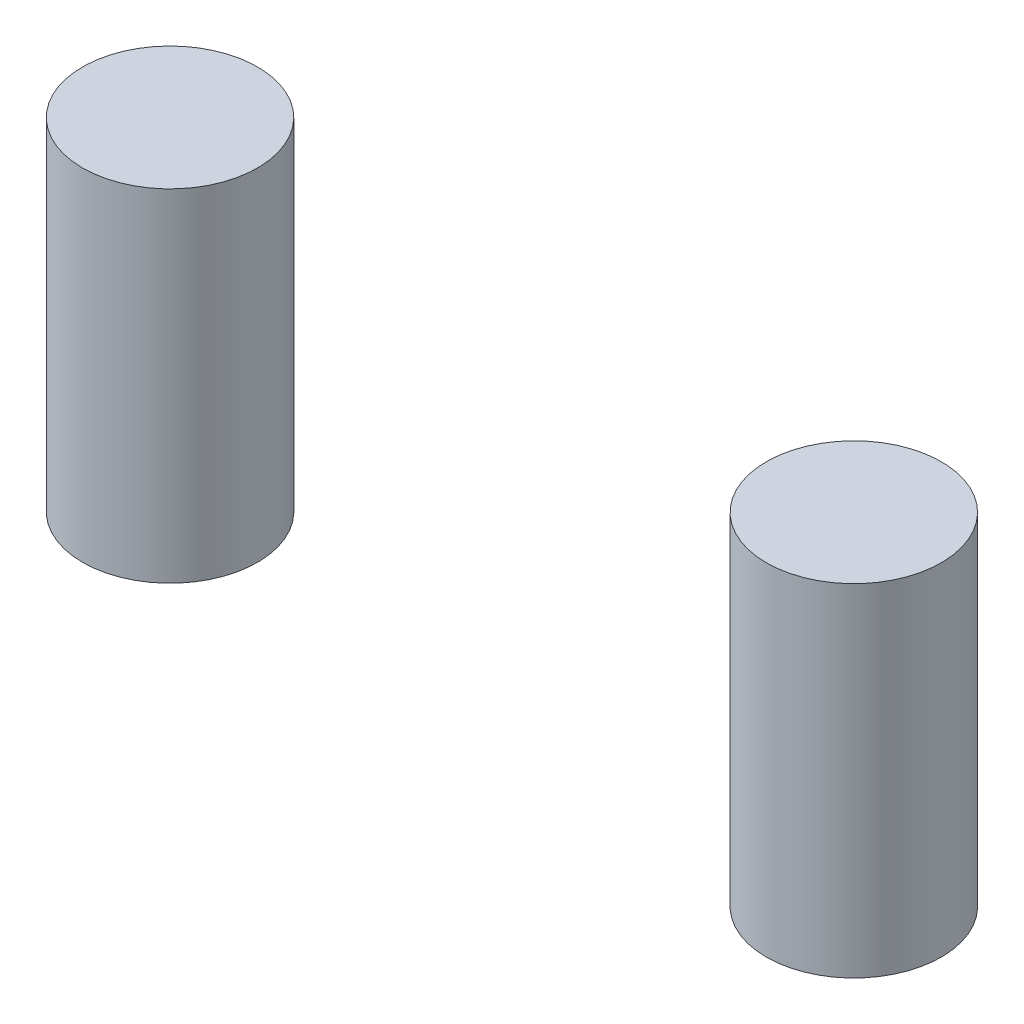
ISO-10303-21;
HEADER;
FILE_DESCRIPTION(('STEP AP214'),'2;1');
FILE_NAME('part.step','',(''),(''),'','','');
FILE_SCHEMA(('AUTOMOTIVE_DESIGN { 1 0 10303 214 1 1 1 1 }'));
ENDSEC;
DATA;
#1=APPLICATION_CONTEXT('core data for automotive mechanical design processes');
#2=APPLICATION_PROTOCOL_DEFINITION('international standard','automotive_design',2000,#1);
#3=PRODUCT_CONTEXT('',#1,'mechanical');
#4=PRODUCT('Part','Part','',(#3));
#5=PRODUCT_RELATED_PRODUCT_CATEGORY('part','',(#4));
#6=PRODUCT_DEFINITION_FORMATION('','',#4);
#7=PRODUCT_DEFINITION_CONTEXT('part definition',#1,'design');
#8=PRODUCT_DEFINITION('design','',#6,#7);
#9=PRODUCT_DEFINITION_SHAPE('','',#8);
#10=(LENGTH_UNIT() NAMED_UNIT(*) SI_UNIT(.MILLI.,.METRE.));
#11=(NAMED_UNIT(*) PLANE_ANGLE_UNIT() SI_UNIT($,.RADIAN.));
#12=(NAMED_UNIT(*) SI_UNIT($,.STERADIAN.) SOLID_ANGLE_UNIT());
#13=UNCERTAINTY_MEASURE_WITH_UNIT(LENGTH_MEASURE(1.E-05),#10,'distance_accuracy_value','');
#14=(GEOMETRIC_REPRESENTATION_CONTEXT(3) GLOBAL_UNCERTAINTY_ASSIGNED_CONTEXT((#13)) GLOBAL_UNIT_ASSIGNED_CONTEXT((#10,
#11,#12)) REPRESENTATION_CONTEXT('',''));
#15=CARTESIAN_POINT('',(0.,0.,0.));
#16=DIRECTION('',(0.,0.,1.));
#17=DIRECTION('',(1.,0.,0.));
#18=AXIS2_PLACEMENT_3D('',#15,#16,#17);
#19=CARTESIAN_POINT('',(27.125,12.,3.09999990463257));
#20=DIRECTION('',(0.,-1.,0.));
#21=DIRECTION('',(0.,0.,-1.));
#22=AXIS2_PLACEMENT_3D('',#19,#20,#21);
#23=CYLINDRICAL_SURFACE('',#22,3.075);
#24=CARTESIAN_POINT('',(27.125,12.,3.09999990463257));
#25=DIRECTION('',(0.,1.,0.));
#26=DIRECTION('',(0.,0.,1.));
#27=AXIS2_PLACEMENT_3D('',#24,#25,#26);
#28=CIRCLE('',#27,3.075);
#29=CARTESIAN_POINT('',(27.125,12.,6.17499990463257));
#30=VERTEX_POINT('',#29);
#31=EDGE_CURVE('E55',#30,#30,#28,.T.);
#32=ORIENTED_EDGE('',*,*,#31,.F.);
#33=EDGE_LOOP('',(#32));
#34=FACE_BOUND('',#33,.T.);
#35=CARTESIAN_POINT('',(27.125,0.,3.09999990463257));
#36=DIRECTION('',(0.,1.,0.));
#37=DIRECTION('',(0.,0.,1.));
#38=AXIS2_PLACEMENT_3D('',#35,#36,#37);
#39=CIRCLE('',#38,3.075);
#40=CARTESIAN_POINT('',(27.125,0.,6.17499990463257));
#41=VERTEX_POINT('',#40);
#42=EDGE_CURVE('E11',#41,#41,#39,.T.);
#43=ORIENTED_EDGE('',*,*,#42,.T.);
#44=EDGE_LOOP('',(#43));
#45=FACE_BOUND('',#44,.T.);
#46=ADVANCED_FACE('F51',(#34,#45),#23,.T.);
#47=CARTESIAN_POINT('',(27.125,12.,3.09999990463257));
#48=DIRECTION('',(0.,1.,0.));
#49=DIRECTION('',(0.,0.,1.));
#50=AXIS2_PLACEMENT_3D('',#47,#48,#49);
#51=PLANE('',#50);
#52=ORIENTED_EDGE('',*,*,#31,.T.);
#53=EDGE_LOOP('',(#52));
#54=FACE_BOUND('',#53,.T.);
#55=ADVANCED_FACE('F53',(#54),#51,.T.);
#56=CARTESIAN_POINT('',(27.125,0.,3.09999990463257));
#57=DIRECTION('',(0.,1.,0.));
#58=DIRECTION('',(0.,0.,1.));
#59=AXIS2_PLACEMENT_3D('',#56,#57,#58);
#60=PLANE('',#59);
#61=ORIENTED_EDGE('',*,*,#42,.F.);
#62=EDGE_LOOP('',(#61));
#63=FACE_BOUND('',#62,.T.);
#64=ADVANCED_FACE('F70',(#63),#60,.F.);
#65=CLOSED_SHELL('',(#46,#55,#64));
#66=MANIFOLD_SOLID_BREP('B2',#65);
#67=CARTESIAN_POINT('',(3.09999942779541,12.,3.09999990463257));
#68=DIRECTION('',(0.,-1.,0.));
#69=DIRECTION('',(0.,0.,-1.));
#70=AXIS2_PLACEMENT_3D('',#67,#68,#69);
#71=CYLINDRICAL_SURFACE('',#70,3.075);
#72=CARTESIAN_POINT('',(3.09999942779541,12.,3.09999990463257));
#73=DIRECTION('',(0.,1.,0.));
#74=DIRECTION('',(0.,0.,1.));
#75=AXIS2_PLACEMENT_3D('',#72,#73,#74);
#76=CIRCLE('',#75,3.075);
#77=CARTESIAN_POINT('',(3.09999942779541,12.,6.17499990463257));
#78=VERTEX_POINT('',#77);
#79=EDGE_CURVE('E50',#78,#78,#76,.T.);
#80=ORIENTED_EDGE('',*,*,#79,.F.);
#81=EDGE_LOOP('',(#80));
#82=FACE_BOUND('',#81,.T.);
#83=CARTESIAN_POINT('',(3.09999942779541,0.,3.09999990463257));
#84=DIRECTION('',(0.,1.,0.));
#85=DIRECTION('',(0.,0.,1.));
#86=AXIS2_PLACEMENT_3D('',#83,#84,#85);
#87=CIRCLE('',#86,3.075);
#88=CARTESIAN_POINT('',(3.09999942779541,0.,6.17499990463257));
#89=VERTEX_POINT('',#88);
#90=EDGE_CURVE('E95',#89,#89,#87,.T.);
#91=ORIENTED_EDGE('',*,*,#90,.T.);
#92=EDGE_LOOP('',(#91));
#93=FACE_BOUND('',#92,.T.);
#94=ADVANCED_FACE('F92',(#82,#93),#71,.T.);
#95=CARTESIAN_POINT('',(3.09999942779541,12.,3.09999990463257));
#96=DIRECTION('',(0.,1.,0.));
#97=DIRECTION('',(0.,0.,1.));
#98=AXIS2_PLACEMENT_3D('',#95,#96,#97);
#99=PLANE('',#98);
#100=ORIENTED_EDGE('',*,*,#79,.T.);
#101=EDGE_LOOP('',(#100));
#102=FACE_BOUND('',#101,.T.);
#103=ADVANCED_FACE('F109',(#102),#99,.T.);
#104=CARTESIAN_POINT('',(3.09999942779541,0.,3.09999990463257));
#105=DIRECTION('',(0.,1.,0.));
#106=DIRECTION('',(0.,0.,1.));
#107=AXIS2_PLACEMENT_3D('',#104,#105,#106);
#108=PLANE('',#107);
#109=ORIENTED_EDGE('',*,*,#90,.F.);
#110=EDGE_LOOP('',(#109));
#111=FACE_BOUND('',#110,.T.);
#112=ADVANCED_FACE('F107',(#111),#108,.F.);
#113=CLOSED_SHELL('',(#94,#103,#112));
#114=MANIFOLD_SOLID_BREP('B6',#113);
#115=ADVANCED_BREP_SHAPE_REPRESENTATION('',(#18,#66,#114),#14);
#116=SHAPE_DEFINITION_REPRESENTATION(#9,#115);
ENDSEC;
END-ISO-10303-21;
